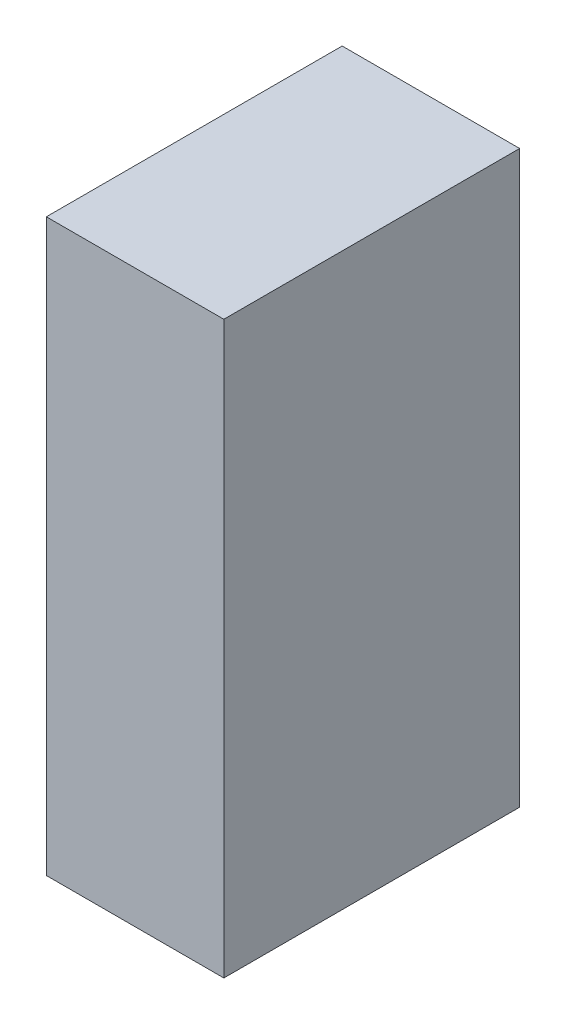
ISO-10303-21;
HEADER;
FILE_DESCRIPTION(('STEP AP214'),'2;1');
FILE_NAME('part.step','',(''),(''),'','','');
FILE_SCHEMA(('AUTOMOTIVE_DESIGN { 1 0 10303 214 1 1 1 1 }'));
ENDSEC;
DATA;
#1=APPLICATION_CONTEXT('core data for automotive mechanical design processes');
#2=APPLICATION_PROTOCOL_DEFINITION('international standard','automotive_design',2000,#1);
#3=PRODUCT_CONTEXT('',#1,'mechanical');
#4=PRODUCT('Part','Part','',(#3));
#5=PRODUCT_RELATED_PRODUCT_CATEGORY('part','',(#4));
#6=PRODUCT_DEFINITION_FORMATION('','',#4);
#7=PRODUCT_DEFINITION_CONTEXT('part definition',#1,'design');
#8=PRODUCT_DEFINITION('design','',#6,#7);
#9=PRODUCT_DEFINITION_SHAPE('','',#8);
#10=(LENGTH_UNIT() NAMED_UNIT(*) SI_UNIT(.MILLI.,.METRE.));
#11=(NAMED_UNIT(*) PLANE_ANGLE_UNIT() SI_UNIT($,.RADIAN.));
#12=(NAMED_UNIT(*) SI_UNIT($,.STERADIAN.) SOLID_ANGLE_UNIT());
#13=UNCERTAINTY_MEASURE_WITH_UNIT(LENGTH_MEASURE(1.E-05),#10,'distance_accuracy_value','');
#14=(GEOMETRIC_REPRESENTATION_CONTEXT(3) GLOBAL_UNCERTAINTY_ASSIGNED_CONTEXT((#13)) GLOBAL_UNIT_ASSIGNED_CONTEXT((#10,
#11,#12)) REPRESENTATION_CONTEXT('',''));
#15=CARTESIAN_POINT('',(0.,0.,0.));
#16=DIRECTION('',(0.,0.,1.));
#17=DIRECTION('',(1.,0.,0.));
#18=AXIS2_PLACEMENT_3D('',#15,#16,#17);
#19=CARTESIAN_POINT('',(0.21000212,0.67499992,0.));
#20=DIRECTION('',(1.,0.,0.));
#21=DIRECTION('',(0.,-1.,0.));
#22=AXIS2_PLACEMENT_3D('',#19,#20,#21);
#23=PLANE('',#22);
#24=DIRECTION('',(0.,0.,1.));
#25=VECTOR('',#24,1.);
#26=CARTESIAN_POINT('',(0.21000212,0.67499992,0.));
#27=LINE('',#26,#25);
#28=CARTESIAN_POINT('',(0.21000212,0.67499992,0.));
#29=VERTEX_POINT('',#28);
#30=CARTESIAN_POINT('',(0.21000212,0.67499992,0.70000114));
#31=VERTEX_POINT('',#30);
#32=EDGE_CURVE('E11',#29,#31,#27,.T.);
#33=ORIENTED_EDGE('',*,*,#32,.T.);
#34=DIRECTION('',(0.,-1.,0.));
#35=VECTOR('',#34,1.);
#36=CARTESIAN_POINT('',(0.21000212,0.67499992,0.70000114));
#37=LINE('',#36,#35);
#38=CARTESIAN_POINT('',(0.21000212,-0.67499992,0.70000114));
#39=VERTEX_POINT('',#38);
#40=EDGE_CURVE('E23',#31,#39,#37,.T.);
#41=ORIENTED_EDGE('',*,*,#40,.T.);
#42=DIRECTION('',(0.,0.,1.));
#43=VECTOR('',#42,1.);
#44=CARTESIAN_POINT('',(0.21000212,-0.67499992,0.));
#45=LINE('',#44,#43);
#46=CARTESIAN_POINT('',(0.21000212,-0.67499992,0.));
#47=VERTEX_POINT('',#46);
#48=EDGE_CURVE('E84',#47,#39,#45,.T.);
#49=ORIENTED_EDGE('',*,*,#48,.F.);
#50=DIRECTION('',(0.,-1.,0.));
#51=VECTOR('',#50,1.);
#52=CARTESIAN_POINT('',(0.21000212,0.67499992,0.));
#53=LINE('',#52,#51);
#54=EDGE_CURVE('E82',#29,#47,#53,.T.);
#55=ORIENTED_EDGE('',*,*,#54,.F.);
#56=EDGE_LOOP('',(#33,#41,#49,#55));
#57=FACE_BOUND('',#56,.T.);
#58=ADVANCED_FACE('F16',(#57),#23,.T.);
#59=CARTESIAN_POINT('',(0.21000212,-0.67499992,0.));
#60=DIRECTION('',(0.,-1.,0.));
#61=DIRECTION('',(-1.,0.,0.));
#62=AXIS2_PLACEMENT_3D('',#59,#60,#61);
#63=PLANE('',#62);
#64=ORIENTED_EDGE('',*,*,#48,.T.);
#65=DIRECTION('',(-1.,0.,0.));
#66=VECTOR('',#65,1.);
#67=CARTESIAN_POINT('',(0.21000212,-0.67499992,0.70000114));
#68=LINE('',#67,#66);
#69=CARTESIAN_POINT('',(-0.20999704,-0.67499992,0.70000114));
#70=VERTEX_POINT('',#69);
#71=EDGE_CURVE('E80',#39,#70,#68,.T.);
#72=ORIENTED_EDGE('',*,*,#71,.T.);
#73=DIRECTION('',(0.,0.,1.));
#74=VECTOR('',#73,1.);
#75=CARTESIAN_POINT('',(-0.20999704,-0.67499992,0.));
#76=LINE('',#75,#74);
#77=CARTESIAN_POINT('',(-0.20999704,-0.67499992,0.));
#78=VERTEX_POINT('',#77);
#79=EDGE_CURVE('E78',#78,#70,#76,.T.);
#80=ORIENTED_EDGE('',*,*,#79,.F.);
#81=DIRECTION('',(-1.,0.,0.));
#82=VECTOR('',#81,1.);
#83=CARTESIAN_POINT('',(0.21000212,-0.67499992,0.));
#84=LINE('',#83,#82);
#85=EDGE_CURVE('E69',#47,#78,#84,.T.);
#86=ORIENTED_EDGE('',*,*,#85,.F.);
#87=EDGE_LOOP('',(#64,#72,#80,#86));
#88=FACE_BOUND('',#87,.T.);
#89=ADVANCED_FACE('F89',(#88),#63,.T.);
#90=CARTESIAN_POINT('',(-0.20999704,-0.67499992,0.));
#91=DIRECTION('',(-0.99999999999823,-1.88148170224543E-06,0.));
#92=DIRECTION('',(-1.88148170224543E-06,0.99999999999823,0.));
#93=AXIS2_PLACEMENT_3D('',#90,#91,#92);
#94=PLANE('',#93);
#95=ORIENTED_EDGE('',*,*,#79,.T.);
#96=DIRECTION('',(-1.88148170224543E-06,0.99999999999823,0.));
#97=VECTOR('',#96,1.);
#98=CARTESIAN_POINT('',(-0.20999704,-0.67499992,0.70000114));
#99=LINE('',#98,#97);
#100=CARTESIAN_POINT('',(-0.20999958,0.67499992,0.70000114));
#101=VERTEX_POINT('',#100);
#102=EDGE_CURVE('E59',#70,#101,#99,.T.);
#103=ORIENTED_EDGE('',*,*,#102,.T.);
#104=DIRECTION('',(0.,0.,1.));
#105=VECTOR('',#104,1.);
#106=CARTESIAN_POINT('',(-0.20999958,0.67499992,0.));
#107=LINE('',#106,#105);
#108=CARTESIAN_POINT('',(-0.20999958,0.67499992,0.));
#109=VERTEX_POINT('',#108);
#110=EDGE_CURVE('E53',#109,#101,#107,.T.);
#111=ORIENTED_EDGE('',*,*,#110,.F.);
#112=DIRECTION('',(-1.88148170224543E-06,0.99999999999823,0.));
#113=VECTOR('',#112,1.);
#114=CARTESIAN_POINT('',(-0.20999704,-0.67499992,0.));
#115=LINE('',#114,#113);
#116=EDGE_CURVE('E57',#78,#109,#115,.T.);
#117=ORIENTED_EDGE('',*,*,#116,.F.);
#118=EDGE_LOOP('',(#95,#103,#111,#117));
#119=FACE_BOUND('',#118,.T.);
#120=ADVANCED_FACE('F56',(#119),#94,.T.);
#121=CARTESIAN_POINT('',(-0.20999958,0.67499992,0.));
#122=DIRECTION('',(0.,1.,0.));
#123=DIRECTION('',(1.,0.,0.));
#124=AXIS2_PLACEMENT_3D('',#121,#122,#123);
#125=PLANE('',#124);
#126=ORIENTED_EDGE('',*,*,#110,.T.);
#127=DIRECTION('',(1.,0.,0.));
#128=VECTOR('',#127,1.);
#129=CARTESIAN_POINT('',(-0.20999958,0.67499992,0.70000114));
#130=LINE('',#129,#128);
#131=EDGE_CURVE('E70',#101,#31,#130,.T.);
#132=ORIENTED_EDGE('',*,*,#131,.T.);
#133=ORIENTED_EDGE('',*,*,#32,.F.);
#134=DIRECTION('',(1.,0.,0.));
#135=VECTOR('',#134,1.);
#136=CARTESIAN_POINT('',(-0.20999958,0.67499992,0.));
#137=LINE('',#136,#135);
#138=EDGE_CURVE('E67',#109,#29,#137,.T.);
#139=ORIENTED_EDGE('',*,*,#138,.F.);
#140=EDGE_LOOP('',(#126,#132,#133,#139));
#141=FACE_BOUND('',#140,.T.);
#142=ADVANCED_FACE('F72',(#141),#125,.T.);
#143=CARTESIAN_POINT('',(0.21000212,0.67499992,0.));
#144=DIRECTION('',(0.,0.,1.));
#145=DIRECTION('',(1.,0.,0.));
#146=AXIS2_PLACEMENT_3D('',#143,#144,#145);
#147=PLANE('',#146);
#148=ORIENTED_EDGE('',*,*,#54,.T.);
#149=ORIENTED_EDGE('',*,*,#85,.T.);
#150=ORIENTED_EDGE('',*,*,#116,.T.);
#151=ORIENTED_EDGE('',*,*,#138,.T.);
#152=EDGE_LOOP('',(#148,#149,#150,#151));
#153=FACE_BOUND('',#152,.T.);
#154=ADVANCED_FACE('F66',(#153),#147,.F.);
#155=CARTESIAN_POINT('',(0.21000212,0.67499992,0.70000114));
#156=DIRECTION('',(0.,0.,1.));
#157=DIRECTION('',(1.,0.,0.));
#158=AXIS2_PLACEMENT_3D('',#155,#156,#157);
#159=PLANE('',#158);
#160=ORIENTED_EDGE('',*,*,#131,.F.);
#161=ORIENTED_EDGE('',*,*,#102,.F.);
#162=ORIENTED_EDGE('',*,*,#71,.F.);
#163=ORIENTED_EDGE('',*,*,#40,.F.);
#164=EDGE_LOOP('',(#160,#161,#162,#163));
#165=FACE_BOUND('',#164,.T.);
#166=ADVANCED_FACE('F90',(#165),#159,.T.);
#167=CLOSED_SHELL('',(#58,#89,#120,#142,#154,#166));
#168=MANIFOLD_SOLID_BREP('B1',#167);
#169=ADVANCED_BREP_SHAPE_REPRESENTATION('',(#18,#168),#14);
#170=SHAPE_DEFINITION_REPRESENTATION(#9,#169);
ENDSEC;
END-ISO-10303-21;
